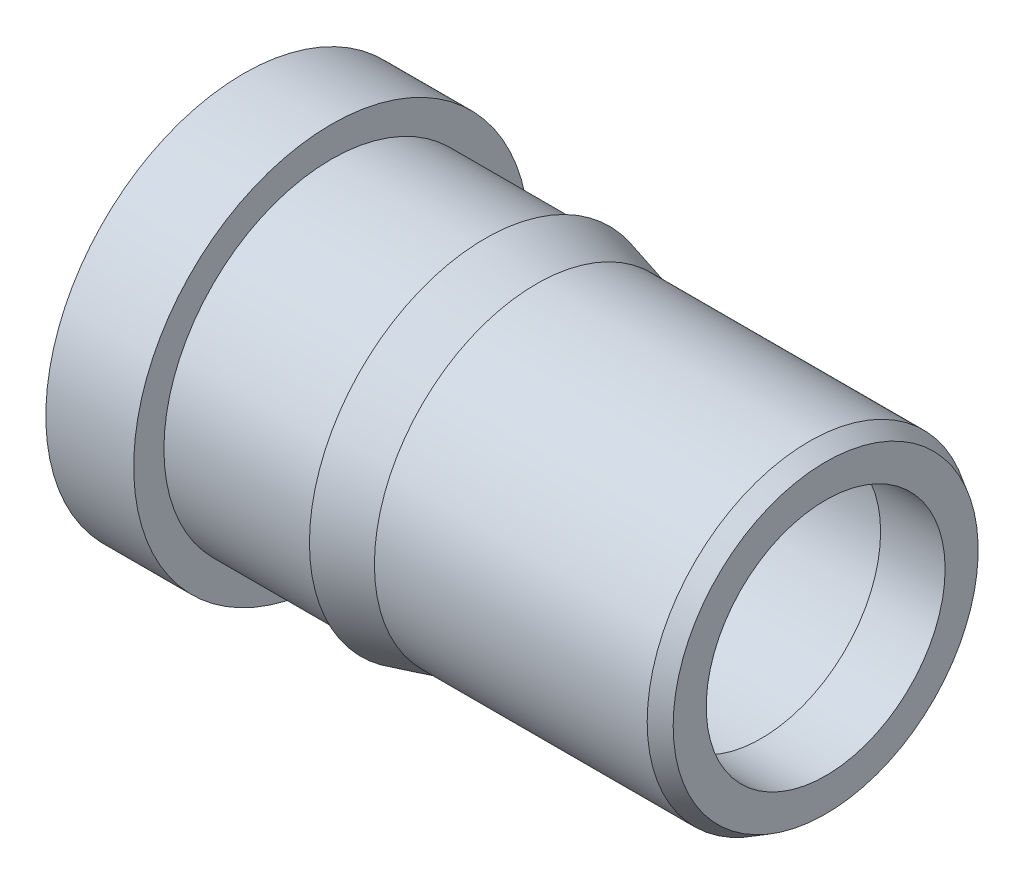
ISO-10303-21;
HEADER;
FILE_DESCRIPTION(('STEP AP214'),'2;1');
FILE_NAME('part.step','',(''),(''),'','','');
FILE_SCHEMA(('AUTOMOTIVE_DESIGN { 1 0 10303 214 1 1 1 1 }'));
ENDSEC;
DATA;
#1=APPLICATION_CONTEXT('core data for automotive mechanical design processes');
#2=APPLICATION_PROTOCOL_DEFINITION('international standard','automotive_design',2000,#1);
#3=PRODUCT_CONTEXT('',#1,'mechanical');
#4=PRODUCT('Part','Part','',(#3));
#5=PRODUCT_RELATED_PRODUCT_CATEGORY('part','',(#4));
#6=PRODUCT_DEFINITION_FORMATION('','',#4);
#7=PRODUCT_DEFINITION_CONTEXT('part definition',#1,'design');
#8=PRODUCT_DEFINITION('design','',#6,#7);
#9=PRODUCT_DEFINITION_SHAPE('','',#8);
#10=(LENGTH_UNIT() NAMED_UNIT(*) SI_UNIT(.MILLI.,.METRE.));
#11=(NAMED_UNIT(*) PLANE_ANGLE_UNIT() SI_UNIT($,.RADIAN.));
#12=(NAMED_UNIT(*) SI_UNIT($,.STERADIAN.) SOLID_ANGLE_UNIT());
#13=UNCERTAINTY_MEASURE_WITH_UNIT(LENGTH_MEASURE(1.E-05),#10,'distance_accuracy_value','');
#14=(GEOMETRIC_REPRESENTATION_CONTEXT(3) GLOBAL_UNCERTAINTY_ASSIGNED_CONTEXT((#13)) GLOBAL_UNIT_ASSIGNED_CONTEXT((#10,
#11,#12)) REPRESENTATION_CONTEXT('',''));
#15=CARTESIAN_POINT('',(0.,0.,0.));
#16=DIRECTION('',(0.,0.,1.));
#17=DIRECTION('',(1.,0.,0.));
#18=AXIS2_PLACEMENT_3D('',#15,#16,#17);
#19=CARTESIAN_POINT('',(1.1176,0.,0.));
#20=DIRECTION('',(-1.,0.,0.));
#21=DIRECTION('',(0.,-1.,0.));
#22=AXIS2_PLACEMENT_3D('',#19,#20,#21);
#23=CYLINDRICAL_SURFACE('',#22,0.7747);
#24=CARTESIAN_POINT('',(0.4064,0.,0.));
#25=DIRECTION('',(-1.,0.,0.));
#26=DIRECTION('',(0.,-1.,0.));
#27=AXIS2_PLACEMENT_3D('',#24,#25,#26);
#28=CIRCLE('',#27,0.7747);
#29=CARTESIAN_POINT('',(0.4064,-0.7747,0.));
#30=VERTEX_POINT('',#29);
#31=EDGE_CURVE('E19',#30,#30,#28,.F.);
#32=ORIENTED_EDGE('',*,*,#31,.T.);
#33=EDGE_LOOP('',(#32));
#34=FACE_BOUND('',#33,.T.);
#35=CARTESIAN_POINT('',(1.1176,0.,0.));
#36=DIRECTION('',(-1.,0.,0.));
#37=DIRECTION('',(0.,-1.,0.));
#38=AXIS2_PLACEMENT_3D('',#35,#36,#37);
#39=CIRCLE('',#38,0.7747);
#40=CARTESIAN_POINT('',(1.1176,-0.7747,0.));
#41=VERTEX_POINT('',#40);
#42=EDGE_CURVE('E57',#41,#41,#39,.T.);
#43=ORIENTED_EDGE('',*,*,#42,.T.);
#44=EDGE_LOOP('',(#43));
#45=FACE_BOUND('',#44,.T.);
#46=ADVANCED_FACE('F15',(#34,#45),#23,.T.);
#47=CARTESIAN_POINT('',(0.4064,-0.9253728,-0.9253728));
#48=DIRECTION('',(-1.,0.,0.));
#49=DIRECTION('',(0.,0.,1.));
#50=AXIS2_PLACEMENT_3D('',#47,#48,#49);
#51=PLANE('',#50);
#52=ORIENTED_EDGE('',*,*,#31,.F.);
#53=EDGE_LOOP('',(#52));
#54=FACE_BOUND('',#53,.T.);
#55=CARTESIAN_POINT('',(0.4064,0.,0.));
#56=DIRECTION('',(-1.,0.,0.));
#57=DIRECTION('',(0.,-1.,0.));
#58=AXIS2_PLACEMENT_3D('',#55,#56,#57);
#59=CIRCLE('',#58,0.9144);
#60=CARTESIAN_POINT('',(0.4064,-0.9144,0.));
#61=VERTEX_POINT('',#60);
#62=EDGE_CURVE('E55',#61,#61,#59,.F.);
#63=ORIENTED_EDGE('',*,*,#62,.T.);
#64=EDGE_LOOP('',(#63));
#65=FACE_BOUND('',#64,.T.);
#66=ADVANCED_FACE('F68',(#54,#65),#51,.F.);
#67=CARTESIAN_POINT('',(1.1176,-0.8225536,0.8225536));
#68=DIRECTION('',(1.,0.,0.));
#69=DIRECTION('',(0.,0.,-1.));
#70=AXIS2_PLACEMENT_3D('',#67,#68,#69);
#71=PLANE('',#70);
#72=ORIENTED_EDGE('',*,*,#42,.F.);
#73=EDGE_LOOP('',(#72));
#74=FACE_BOUND('',#73,.T.);
#75=CARTESIAN_POINT('',(1.11759999999994,0.,0.));
#76=DIRECTION('',(-1.,0.,0.));
#77=DIRECTION('',(0.,0.,1.));
#78=AXIS2_PLACEMENT_3D('',#75,#76,#77);
#79=CIRCLE('',#78,0.812800000000016);
#80=CARTESIAN_POINT('',(1.11759999999994,0.,0.812800000000016));
#81=VERTEX_POINT('',#80);
#82=EDGE_CURVE('E52',#81,#81,#79,.T.);
#83=ORIENTED_EDGE('',*,*,#82,.T.);
#84=EDGE_LOOP('',(#83));
#85=FACE_BOUND('',#84,.T.);
#86=ADVANCED_FACE('F71',(#74,#85),#71,.F.);
#87=CARTESIAN_POINT('',(0.4064,0.,0.));
#88=DIRECTION('',(-1.,0.,0.));
#89=DIRECTION('',(0.,-1.,0.));
#90=AXIS2_PLACEMENT_3D('',#87,#88,#89);
#91=CYLINDRICAL_SURFACE('',#90,0.9144);
#92=CARTESIAN_POINT('',(0.,0.,0.));
#93=DIRECTION('',(-1.,0.,0.));
#94=DIRECTION('',(0.,-1.,0.));
#95=AXIS2_PLACEMENT_3D('',#92,#93,#94);
#96=CIRCLE('',#95,0.9144);
#97=CARTESIAN_POINT('',(0.,-0.9144,0.));
#98=VERTEX_POINT('',#97);
#99=EDGE_CURVE('E48',#98,#98,#96,.F.);
#100=ORIENTED_EDGE('',*,*,#99,.T.);
#101=EDGE_LOOP('',(#100));
#102=FACE_BOUND('',#101,.T.);
#103=ORIENTED_EDGE('',*,*,#62,.F.);
#104=EDGE_LOOP('',(#103));
#105=FACE_BOUND('',#104,.T.);
#106=ADVANCED_FACE('F75',(#102,#105),#91,.T.);
#107=CARTESIAN_POINT('',(1.3545852258,0.,0.));
#108=DIRECTION('',(-1.,0.,0.));
#109=DIRECTION('',(0.,0.,1.));
#110=AXIS2_PLACEMENT_3D('',#107,#108,#109);
#111=CONICAL_SURFACE('',#110,0.7493,0.261799388306168);
#112=ORIENTED_EDGE('',*,*,#82,.F.);
#113=EDGE_LOOP('',(#112));
#114=FACE_BOUND('',#113,.T.);
#115=CARTESIAN_POINT('',(1.3545852258,0.,0.));
#116=DIRECTION('',(-1.,0.,0.));
#117=DIRECTION('',(0.,0.,1.));
#118=AXIS2_PLACEMENT_3D('',#115,#116,#117);
#119=CIRCLE('',#118,0.7493);
#120=CARTESIAN_POINT('',(1.3545852258,0.,0.7493));
#121=VERTEX_POINT('',#120);
#122=EDGE_CURVE('E37',#121,#121,#119,.T.);
#123=ORIENTED_EDGE('',*,*,#122,.T.);
#124=EDGE_LOOP('',(#123));
#125=FACE_BOUND('',#124,.T.);
#126=ADVANCED_FACE('F77',(#114,#125),#111,.T.);
#127=CARTESIAN_POINT('',(0.,-0.9253728,0.9253728));
#128=DIRECTION('',(1.,0.,0.));
#129=DIRECTION('',(0.,0.,-1.));
#130=AXIS2_PLACEMENT_3D('',#127,#128,#129);
#131=PLANE('',#130);
#132=CARTESIAN_POINT('',(0.,0.,0.));
#133=DIRECTION('',(-1.,0.,0.));
#134=DIRECTION('',(0.,0.,1.));
#135=AXIS2_PLACEMENT_3D('',#132,#133,#134);
#136=CIRCLE('',#135,0.6477);
#137=CARTESIAN_POINT('',(0.,0.,0.6477));
#138=VERTEX_POINT('',#137);
#139=EDGE_CURVE('E43',#138,#138,#136,.T.);
#140=ORIENTED_EDGE('',*,*,#139,.F.);
#141=EDGE_LOOP('',(#140));
#142=FACE_BOUND('',#141,.T.);
#143=ORIENTED_EDGE('',*,*,#99,.F.);
#144=EDGE_LOOP('',(#143));
#145=FACE_BOUND('',#144,.T.);
#146=ADVANCED_FACE('F85',(#142,#145),#131,.F.);
#147=CARTESIAN_POINT('',(2.6162,0.,0.));
#148=DIRECTION('',(-1.,0.,0.));
#149=DIRECTION('',(0.,0.,1.));
#150=AXIS2_PLACEMENT_3D('',#147,#148,#149);
#151=CYLINDRICAL_SURFACE('',#150,0.7493);
#152=ORIENTED_EDGE('',*,*,#122,.F.);
#153=EDGE_LOOP('',(#152));
#154=FACE_BOUND('',#153,.T.);
#155=CARTESIAN_POINT('',(2.61620000000007,0.,0.));
#156=DIRECTION('',(-1.,0.,0.));
#157=DIRECTION('',(0.,0.,1.));
#158=AXIS2_PLACEMENT_3D('',#155,#156,#157);
#159=CIRCLE('',#158,0.7493);
#160=CARTESIAN_POINT('',(2.6162,0.,0.7493));
#161=VERTEX_POINT('',#160);
#162=EDGE_CURVE('E47',#161,#161,#159,.T.);
#163=ORIENTED_EDGE('',*,*,#162,.T.);
#164=EDGE_LOOP('',(#163));
#165=FACE_BOUND('',#164,.T.);
#166=ADVANCED_FACE('F111',(#154,#165),#151,.T.);
#167=CARTESIAN_POINT('',(2.3368,0.,0.));
#168=DIRECTION('',(-1.,0.,0.));
#169=DIRECTION('',(0.,0.,1.));
#170=AXIS2_PLACEMENT_3D('',#167,#168,#169);
#171=CYLINDRICAL_SURFACE('',#170,0.6477);
#172=ORIENTED_EDGE('',*,*,#139,.T.);
#173=EDGE_LOOP('',(#172));
#174=FACE_BOUND('',#173,.T.);
#175=CARTESIAN_POINT('',(2.33680000000003,0.,0.));
#176=DIRECTION('',(-1.,0.,0.));
#177=DIRECTION('',(0.,0.,1.));
#178=AXIS2_PLACEMENT_3D('',#175,#176,#177);
#179=CIRCLE('',#178,0.6477);
#180=CARTESIAN_POINT('',(2.3368,0.,0.6477));
#181=VERTEX_POINT('',#180);
#182=EDGE_CURVE('E42',#181,#181,#179,.T.);
#183=ORIENTED_EDGE('',*,*,#182,.F.);
#184=EDGE_LOOP('',(#183));
#185=FACE_BOUND('',#184,.T.);
#186=ADVANCED_FACE('F107',(#174,#185),#171,.F.);
#187=CARTESIAN_POINT('',(2.6924,0.,0.));
#188=DIRECTION('',(-1.,0.,0.));
#189=DIRECTION('',(0.,0.,1.));
#190=AXIS2_PLACEMENT_3D('',#187,#188,#189);
#191=CONICAL_SURFACE('',#190,0.7053059046,0.523598823706077);
#192=ORIENTED_EDGE('',*,*,#162,.F.);
#193=EDGE_LOOP('',(#192));
#194=FACE_BOUND('',#193,.T.);
#195=CARTESIAN_POINT('',(2.69240000000004,0.,0.));
#196=DIRECTION('',(-1.,0.,0.));
#197=DIRECTION('',(0.,0.,1.));
#198=AXIS2_PLACEMENT_3D('',#195,#196,#197);
#199=CIRCLE('',#198,0.705305904599978);
#200=CARTESIAN_POINT('',(2.69240000000004,0.,0.705305904599978));
#201=VERTEX_POINT('',#200);
#202=EDGE_CURVE('E33',#201,#201,#199,.T.);
#203=ORIENTED_EDGE('',*,*,#202,.T.);
#204=EDGE_LOOP('',(#203));
#205=FACE_BOUND('',#204,.T.);
#206=ADVANCED_FACE('F103',(#194,#205),#191,.T.);
#207=CARTESIAN_POINT('',(2.3940319658,0.,0.));
#208=DIRECTION('',(-1.,0.,0.));
#209=DIRECTION('',(0.,0.,1.));
#210=AXIS2_PLACEMENT_3D('',#207,#208,#209);
#211=CONICAL_SURFACE('',#210,0.55245,1.02974432163927);
#212=CARTESIAN_POINT('',(2.3940319658,0.,0.));
#213=DIRECTION('',(1.,0.,0.));
#214=DIRECTION('',(0.,0.,-1.));
#215=AXIS2_PLACEMENT_3D('',#212,#213,#214);
#216=CIRCLE('',#215,0.55245);
#217=CARTESIAN_POINT('',(2.3940319658,0.,-0.55245));
#218=VERTEX_POINT('',#217);
#219=EDGE_CURVE('E24',#218,#218,#216,.F.);
#220=ORIENTED_EDGE('',*,*,#219,.F.);
#221=EDGE_LOOP('',(#220));
#222=FACE_BOUND('',#221,.T.);
#223=ORIENTED_EDGE('',*,*,#182,.T.);
#224=EDGE_LOOP('',(#223));
#225=FACE_BOUND('',#224,.T.);
#226=ADVANCED_FACE('F98',(#222,#225),#211,.F.);
#227=CARTESIAN_POINT('',(2.6924,-0.713769591,-0.713769591));
#228=DIRECTION('',(-1.,0.,0.));
#229=DIRECTION('',(0.,0.,1.));
#230=AXIS2_PLACEMENT_3D('',#227,#228,#229);
#231=PLANE('',#230);
#232=CARTESIAN_POINT('',(2.6924,0.,0.));
#233=DIRECTION('',(1.,0.,0.));
#234=DIRECTION('',(0.,0.,-1.));
#235=AXIS2_PLACEMENT_3D('',#232,#233,#234);
#236=CIRCLE('',#235,0.55245);
#237=CARTESIAN_POINT('',(2.6924,0.,-0.55245));
#238=VERTEX_POINT('',#237);
#239=EDGE_CURVE('E10',#238,#238,#236,.T.);
#240=ORIENTED_EDGE('',*,*,#239,.F.);
#241=EDGE_LOOP('',(#240));
#242=FACE_BOUND('',#241,.T.);
#243=ORIENTED_EDGE('',*,*,#202,.F.);
#244=EDGE_LOOP('',(#243));
#245=FACE_BOUND('',#244,.T.);
#246=ADVANCED_FACE('F17',(#242,#245),#231,.F.);
#247=CARTESIAN_POINT('',(2.3940319658,0.,0.));
#248=DIRECTION('',(1.,0.,0.));
#249=DIRECTION('',(0.,0.,-1.));
#250=AXIS2_PLACEMENT_3D('',#247,#248,#249);
#251=CYLINDRICAL_SURFACE('',#250,0.55245);
#252=ORIENTED_EDGE('',*,*,#219,.T.);
#253=EDGE_LOOP('',(#252));
#254=FACE_BOUND('',#253,.T.);
#255=ORIENTED_EDGE('',*,*,#239,.T.);
#256=EDGE_LOOP('',(#255));
#257=FACE_BOUND('',#256,.T.);
#258=ADVANCED_FACE('F91',(#254,#257),#251,.F.);
#259=CLOSED_SHELL('',(#46,#66,#86,#106,#126,#146,#166,#186,#206,#226,#246,#258));
#260=MANIFOLD_SOLID_BREP('B1',#259);
#261=ADVANCED_BREP_SHAPE_REPRESENTATION('',(#18,#260),#14);
#262=SHAPE_DEFINITION_REPRESENTATION(#9,#261);
ENDSEC;
END-ISO-10303-21;
